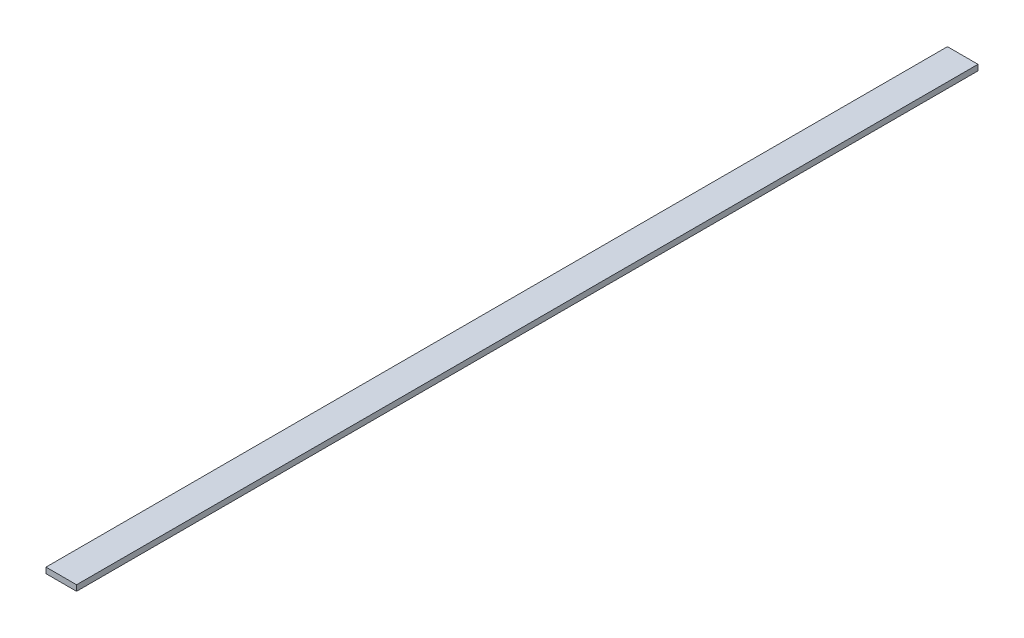
ISO-10303-21;
HEADER;
FILE_DESCRIPTION(('STEP AP214'),'2;1');
FILE_NAME('part.step','',(''),(''),'','','');
FILE_SCHEMA(('AUTOMOTIVE_DESIGN { 1 0 10303 214 1 1 1 1 }'));
ENDSEC;
DATA;
#1=APPLICATION_CONTEXT('core data for automotive mechanical design processes');
#2=APPLICATION_PROTOCOL_DEFINITION('international standard','automotive_design',2000,#1);
#3=PRODUCT_CONTEXT('',#1,'mechanical');
#4=PRODUCT('Part','Part','',(#3));
#5=PRODUCT_RELATED_PRODUCT_CATEGORY('part','',(#4));
#6=PRODUCT_DEFINITION_FORMATION('','',#4);
#7=PRODUCT_DEFINITION_CONTEXT('part definition',#1,'design');
#8=PRODUCT_DEFINITION('design','',#6,#7);
#9=PRODUCT_DEFINITION_SHAPE('','',#8);
#10=(LENGTH_UNIT() NAMED_UNIT(*) SI_UNIT(.MILLI.,.METRE.));
#11=(NAMED_UNIT(*) PLANE_ANGLE_UNIT() SI_UNIT($,.RADIAN.));
#12=(NAMED_UNIT(*) SI_UNIT($,.STERADIAN.) SOLID_ANGLE_UNIT());
#13=UNCERTAINTY_MEASURE_WITH_UNIT(LENGTH_MEASURE(1.E-05),#10,'distance_accuracy_value','');
#14=(GEOMETRIC_REPRESENTATION_CONTEXT(3) GLOBAL_UNCERTAINTY_ASSIGNED_CONTEXT((#13)) GLOBAL_UNIT_ASSIGNED_CONTEXT((#10,
#11,#12)) REPRESENTATION_CONTEXT('',''));
#15=CARTESIAN_POINT('',(0.,0.,0.));
#16=DIRECTION('',(0.,0.,1.));
#17=DIRECTION('',(1.,0.,0.));
#18=AXIS2_PLACEMENT_3D('',#15,#16,#17);
#19=CARTESIAN_POINT('',(-14.2875,5.55625,0.));
#20=DIRECTION('',(0.,1.,0.));
#21=DIRECTION('',(0.,0.,1.));
#22=AXIS2_PLACEMENT_3D('',#19,#20,#21);
#23=PLANE('',#22);
#24=DIRECTION('',(1.,0.,0.));
#25=VECTOR('',#24,1.);
#26=CARTESIAN_POINT('',(-7.9375,5.55625,374.65));
#27=LINE('',#26,#25);
#28=CARTESIAN_POINT('',(-1.5875,5.55625,374.65));
#29=VERTEX_POINT('',#28);
#30=CARTESIAN_POINT('',(-14.2875,5.55625,374.65));
#31=VERTEX_POINT('',#30);
#32=EDGE_CURVE('E68',#29,#31,#27,.F.);
#33=ORIENTED_EDGE('',*,*,#32,.F.);
#34=DIRECTION('',(0.,0.,-1.));
#35=VECTOR('',#34,1.);
#36=CARTESIAN_POINT('',(-1.5875,5.55625,0.));
#37=LINE('',#36,#35);
#38=CARTESIAN_POINT('',(-1.5875,5.55625,0.));
#39=VERTEX_POINT('',#38);
#40=EDGE_CURVE('E55',#39,#29,#37,.F.);
#41=ORIENTED_EDGE('',*,*,#40,.F.);
#42=DIRECTION('',(1.,0.,0.));
#43=VECTOR('',#42,1.);
#44=CARTESIAN_POINT('',(-7.9375,5.55625,0.));
#45=LINE('',#44,#43);
#46=CARTESIAN_POINT('',(-14.2875,5.55625,0.));
#47=VERTEX_POINT('',#46);
#48=EDGE_CURVE('E20',#39,#47,#45,.F.);
#49=ORIENTED_EDGE('',*,*,#48,.T.);
#50=DIRECTION('',(0.,0.,1.));
#51=VECTOR('',#50,1.);
#52=CARTESIAN_POINT('',(-14.2875,5.55625,0.));
#53=LINE('',#52,#51);
#54=EDGE_CURVE('E81',#31,#47,#53,.F.);
#55=ORIENTED_EDGE('',*,*,#54,.F.);
#56=EDGE_LOOP('',(#33,#41,#49,#55));
#57=FACE_BOUND('',#56,.T.);
#58=ADVANCED_FACE('F17',(#57),#23,.T.);
#59=CARTESIAN_POINT('',(-7.9375,4.365625,0.));
#60=DIRECTION('',(0.,0.,1.));
#61=DIRECTION('',(1.,0.,0.));
#62=AXIS2_PLACEMENT_3D('',#59,#60,#61);
#63=PLANE('',#62);
#64=ORIENTED_EDGE('',*,*,#48,.F.);
#65=DIRECTION('',(0.,1.,0.));
#66=VECTOR('',#65,1.);
#67=CARTESIAN_POINT('',(-1.5875,5.55625,0.));
#68=LINE('',#67,#66);
#69=CARTESIAN_POINT('',(-1.5875,3.175,0.));
#70=VERTEX_POINT('',#69);
#71=EDGE_CURVE('E61',#70,#39,#68,.T.);
#72=ORIENTED_EDGE('',*,*,#71,.F.);
#73=DIRECTION('',(1.,0.,0.));
#74=VECTOR('',#73,1.);
#75=CARTESIAN_POINT('',(-1.5875,3.175,0.));
#76=LINE('',#75,#74);
#77=CARTESIAN_POINT('',(-14.2875,3.175,0.));
#78=VERTEX_POINT('',#77);
#79=EDGE_CURVE('E83',#78,#70,#76,.T.);
#80=ORIENTED_EDGE('',*,*,#79,.F.);
#81=DIRECTION('',(0.,1.,0.));
#82=VECTOR('',#81,1.);
#83=CARTESIAN_POINT('',(-14.2875,3.175,0.));
#84=LINE('',#83,#82);
#85=EDGE_CURVE('E64',#47,#78,#84,.F.);
#86=ORIENTED_EDGE('',*,*,#85,.F.);
#87=EDGE_LOOP('',(#64,#72,#80,#86));
#88=FACE_BOUND('',#87,.T.);
#89=ADVANCED_FACE('F60',(#88),#63,.F.);
#90=CARTESIAN_POINT('',(-1.5875,5.55625,0.));
#91=DIRECTION('',(1.,0.,0.));
#92=DIRECTION('',(0.,0.,-1.));
#93=AXIS2_PLACEMENT_3D('',#90,#91,#92);
#94=PLANE('',#93);
#95=DIRECTION('',(0.,1.,0.));
#96=VECTOR('',#95,1.);
#97=CARTESIAN_POINT('',(-1.5875,4.365625,374.65));
#98=LINE('',#97,#96);
#99=CARTESIAN_POINT('',(-1.5875,3.175,374.65));
#100=VERTEX_POINT('',#99);
#101=EDGE_CURVE('E70',#100,#29,#98,.T.);
#102=ORIENTED_EDGE('',*,*,#101,.F.);
#103=DIRECTION('',(0.,0.,-1.));
#104=VECTOR('',#103,1.);
#105=CARTESIAN_POINT('',(-1.5875,3.175,0.));
#106=LINE('',#105,#104);
#107=EDGE_CURVE('E74',#70,#100,#106,.F.);
#108=ORIENTED_EDGE('',*,*,#107,.F.);
#109=ORIENTED_EDGE('',*,*,#71,.T.);
#110=ORIENTED_EDGE('',*,*,#40,.T.);
#111=EDGE_LOOP('',(#102,#108,#109,#110));
#112=FACE_BOUND('',#111,.T.);
#113=ADVANCED_FACE('F72',(#112),#94,.T.);
#114=CARTESIAN_POINT('',(-7.9375,4.365625,374.65));
#115=DIRECTION('',(0.,0.,1.));
#116=DIRECTION('',(1.,0.,0.));
#117=AXIS2_PLACEMENT_3D('',#114,#115,#116);
#118=PLANE('',#117);
#119=DIRECTION('',(0.,1.,0.));
#120=VECTOR('',#119,1.);
#121=CARTESIAN_POINT('',(-14.2875,3.175,374.65));
#122=LINE('',#121,#120);
#123=CARTESIAN_POINT('',(-14.2875,3.175,374.65));
#124=VERTEX_POINT('',#123);
#125=EDGE_CURVE('E35',#124,#31,#122,.T.);
#126=ORIENTED_EDGE('',*,*,#125,.F.);
#127=DIRECTION('',(1.,0.,0.));
#128=VECTOR('',#127,1.);
#129=CARTESIAN_POINT('',(-1.5875,3.175,374.65));
#130=LINE('',#129,#128);
#131=EDGE_CURVE('E26',#100,#124,#130,.F.);
#132=ORIENTED_EDGE('',*,*,#131,.F.);
#133=ORIENTED_EDGE('',*,*,#101,.T.);
#134=ORIENTED_EDGE('',*,*,#32,.T.);
#135=EDGE_LOOP('',(#126,#132,#133,#134));
#136=FACE_BOUND('',#135,.T.);
#137=ADVANCED_FACE('F89',(#136),#118,.T.);
#138=CARTESIAN_POINT('',(-14.2875,3.175,0.));
#139=DIRECTION('',(-1.,0.,0.));
#140=DIRECTION('',(0.,0.,1.));
#141=AXIS2_PLACEMENT_3D('',#138,#139,#140);
#142=PLANE('',#141);
#143=ORIENTED_EDGE('',*,*,#125,.T.);
#144=ORIENTED_EDGE('',*,*,#54,.T.);
#145=ORIENTED_EDGE('',*,*,#85,.T.);
#146=DIRECTION('',(0.,0.,-1.));
#147=VECTOR('',#146,1.);
#148=CARTESIAN_POINT('',(-14.2875,3.175,0.));
#149=LINE('',#148,#147);
#150=EDGE_CURVE('E11',#124,#78,#149,.T.);
#151=ORIENTED_EDGE('',*,*,#150,.F.);
#152=EDGE_LOOP('',(#143,#144,#145,#151));
#153=FACE_BOUND('',#152,.T.);
#154=ADVANCED_FACE('F91',(#153),#142,.T.);
#155=CARTESIAN_POINT('',(-1.5875,3.175,0.));
#156=DIRECTION('',(0.,-1.,0.));
#157=DIRECTION('',(0.,0.,-1.));
#158=AXIS2_PLACEMENT_3D('',#155,#156,#157);
#159=PLANE('',#158);
#160=ORIENTED_EDGE('',*,*,#131,.T.);
#161=ORIENTED_EDGE('',*,*,#150,.T.);
#162=ORIENTED_EDGE('',*,*,#79,.T.);
#163=ORIENTED_EDGE('',*,*,#107,.T.);
#164=EDGE_LOOP('',(#160,#161,#162,#163));
#165=FACE_BOUND('',#164,.T.);
#166=ADVANCED_FACE('F88',(#165),#159,.T.);
#167=CLOSED_SHELL('',(#58,#89,#113,#137,#154,#166));
#168=MANIFOLD_SOLID_BREP('B1',#167);
#169=ADVANCED_BREP_SHAPE_REPRESENTATION('',(#18,#168),#14);
#170=SHAPE_DEFINITION_REPRESENTATION(#9,#169);
ENDSEC;
END-ISO-10303-21;
